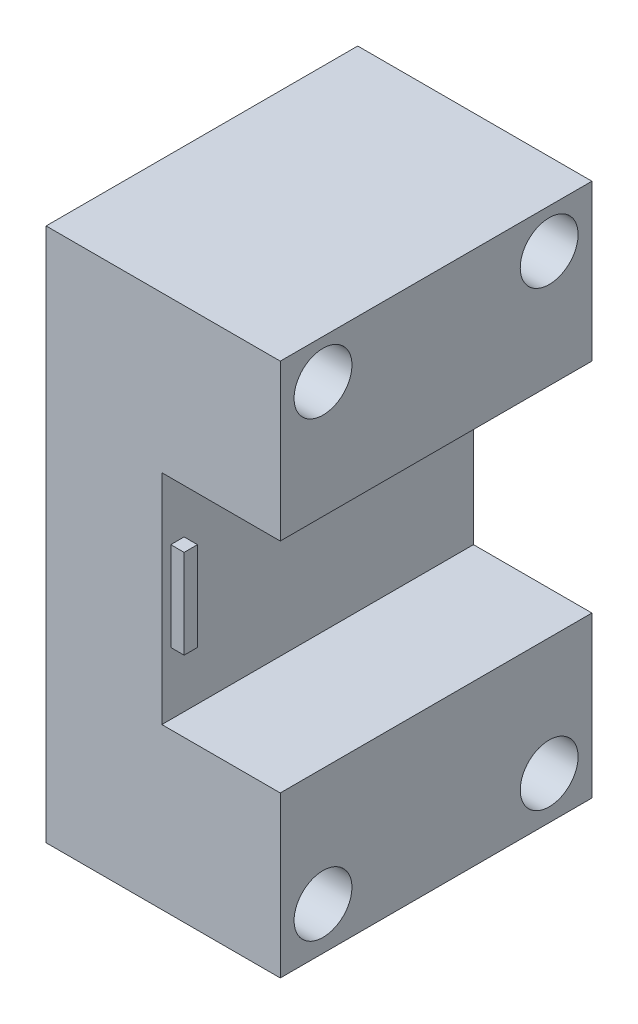
ISO-10303-21;
HEADER;
FILE_DESCRIPTION(('STEP AP214'),'2;1');
FILE_NAME('part.step','',(''),(''),'','','');
FILE_SCHEMA(('AUTOMOTIVE_DESIGN { 1 0 10303 214 1 1 1 1 }'));
ENDSEC;
DATA;
#1=APPLICATION_CONTEXT('core data for automotive mechanical design processes');
#2=APPLICATION_PROTOCOL_DEFINITION('international standard','automotive_design',2000,#1);
#3=PRODUCT_CONTEXT('',#1,'mechanical');
#4=PRODUCT('Part','Part','',(#3));
#5=PRODUCT_RELATED_PRODUCT_CATEGORY('part','',(#4));
#6=PRODUCT_DEFINITION_FORMATION('','',#4);
#7=PRODUCT_DEFINITION_CONTEXT('part definition',#1,'design');
#8=PRODUCT_DEFINITION('design','',#6,#7);
#9=PRODUCT_DEFINITION_SHAPE('','',#8);
#10=(LENGTH_UNIT() NAMED_UNIT(*) SI_UNIT(.MILLI.,.METRE.));
#11=(NAMED_UNIT(*) PLANE_ANGLE_UNIT() SI_UNIT($,.RADIAN.));
#12=(NAMED_UNIT(*) SI_UNIT($,.STERADIAN.) SOLID_ANGLE_UNIT());
#13=UNCERTAINTY_MEASURE_WITH_UNIT(LENGTH_MEASURE(1.E-05),#10,'distance_accuracy_value','');
#14=(GEOMETRIC_REPRESENTATION_CONTEXT(3) GLOBAL_UNCERTAINTY_ASSIGNED_CONTEXT((#13)) GLOBAL_UNIT_ASSIGNED_CONTEXT((#10,
#11,#12)) REPRESENTATION_CONTEXT('',''));
#15=CARTESIAN_POINT('',(0.,0.,0.));
#16=DIRECTION('',(0.,0.,1.));
#17=DIRECTION('',(1.,0.,0.));
#18=AXIS2_PLACEMENT_3D('',#15,#16,#17);
#19=CARTESIAN_POINT('',(13.,60.,-35.));
#20=DIRECTION('',(-1.,0.,0.));
#21=DIRECTION('',(0.,-1.,0.));
#22=AXIS2_PLACEMENT_3D('',#19,#20,#21);
#23=PLANE('',#22);
#24=DIRECTION('',(0.,-1.,0.));
#25=VECTOR('',#24,1.);
#26=CARTESIAN_POINT('',(13.,60.,0.));
#27=LINE('',#26,#25);
#28=CARTESIAN_POINT('',(13.,42.5,0.));
#29=VERTEX_POINT('',#28);
#30=CARTESIAN_POINT('',(13.,18.,0.));
#31=VERTEX_POINT('',#30);
#32=EDGE_CURVE('E63',#29,#31,#27,.T.);
#33=ORIENTED_EDGE('',*,*,#32,.T.);
#34=DIRECTION('',(0.,0.,1.));
#35=VECTOR('',#34,1.);
#36=CARTESIAN_POINT('',(13.,18.,-57.3805719319235));
#37=LINE('',#36,#35);
#38=CARTESIAN_POINT('',(13.,18.,-35.));
#39=VERTEX_POINT('',#38);
#40=EDGE_CURVE('E58',#39,#31,#37,.T.);
#41=ORIENTED_EDGE('',*,*,#40,.F.);
#42=DIRECTION('',(0.,-1.,0.));
#43=VECTOR('',#42,1.);
#44=CARTESIAN_POINT('',(13.,60.,-35.));
#45=LINE('',#44,#43);
#46=CARTESIAN_POINT('',(13.,42.5,-35.));
#47=VERTEX_POINT('',#46);
#48=EDGE_CURVE('E137',#47,#39,#45,.T.);
#49=ORIENTED_EDGE('',*,*,#48,.F.);
#50=DIRECTION('',(0.,0.,1.));
#51=VECTOR('',#50,1.);
#52=CARTESIAN_POINT('',(13.,42.5,-57.3805719319235));
#53=LINE('',#52,#51);
#54=EDGE_CURVE('E172',#47,#29,#53,.T.);
#55=ORIENTED_EDGE('',*,*,#54,.T.);
#56=EDGE_LOOP('',(#33,#41,#49,#55));
#57=FACE_BOUND('',#56,.T.);
#58=DIRECTION('',(0.,-1.,0.));
#59=VECTOR('',#58,1.);
#60=CARTESIAN_POINT('',(13.,25.,-1.));
#61=LINE('',#60,#59);
#62=CARTESIAN_POINT('',(13.,35.,-1.));
#63=VERTEX_POINT('',#62);
#64=CARTESIAN_POINT('',(13.,25.,-1.));
#65=VERTEX_POINT('',#64);
#66=EDGE_CURVE('E179',#63,#65,#61,.T.);
#67=ORIENTED_EDGE('',*,*,#66,.F.);
#68=DIRECTION('',(0.,0.,1.));
#69=VECTOR('',#68,1.);
#70=CARTESIAN_POINT('',(13.,35.,-1.));
#71=LINE('',#70,#69);
#72=CARTESIAN_POINT('',(13.,35.,-2.5));
#73=VERTEX_POINT('',#72);
#74=EDGE_CURVE('E184',#73,#63,#71,.T.);
#75=ORIENTED_EDGE('',*,*,#74,.F.);
#76=DIRECTION('',(0.,1.,0.));
#77=VECTOR('',#76,1.);
#78=CARTESIAN_POINT('',(13.,25.,-2.5));
#79=LINE('',#78,#77);
#80=CARTESIAN_POINT('',(13.,25.,-2.5));
#81=VERTEX_POINT('',#80);
#82=EDGE_CURVE('E196',#81,#73,#79,.T.);
#83=ORIENTED_EDGE('',*,*,#82,.F.);
#84=DIRECTION('',(0.,0.,-1.));
#85=VECTOR('',#84,1.);
#86=CARTESIAN_POINT('',(13.,25.,-1.));
#87=LINE('',#86,#85);
#88=EDGE_CURVE('E193',#65,#81,#87,.T.);
#89=ORIENTED_EDGE('',*,*,#88,.F.);
#90=EDGE_LOOP('',(#67,#75,#83,#89));
#91=FACE_BOUND('',#90,.T.);
#92=ADVANCED_FACE('F43',(#57,#91),#23,.F.);
#93=CARTESIAN_POINT('',(0.,60.,-35.));
#94=DIRECTION('',(-1.,0.,0.));
#95=DIRECTION('',(0.,-1.,0.));
#96=AXIS2_PLACEMENT_3D('',#93,#94,#95);
#97=PLANE('',#96);
#98=CARTESIAN_POINT('',(0.,55.6,-4.8));
#99=DIRECTION('',(1.,0.,0.));
#100=DIRECTION('',(0.,1.,0.));
#101=AXIS2_PLACEMENT_3D('',#98,#99,#100);
#102=CIRCLE('',#101,3.25);
#103=CARTESIAN_POINT('',(0.,58.85,-4.8));
#104=VERTEX_POINT('',#103);
#105=EDGE_CURVE('E334',#104,#104,#102,.T.);
#106=ORIENTED_EDGE('',*,*,#105,.T.);
#107=EDGE_LOOP('',(#106));
#108=FACE_BOUND('',#107,.T.);
#109=CARTESIAN_POINT('',(0.,55.6,-30.2));
#110=DIRECTION('',(1.,0.,0.));
#111=DIRECTION('',(0.,1.,0.));
#112=AXIS2_PLACEMENT_3D('',#109,#110,#111);
#113=CIRCLE('',#112,3.24999999999998);
#114=CARTESIAN_POINT('',(0.,58.85,-30.2));
#115=VERTEX_POINT('',#114);
#116=EDGE_CURVE('E328',#115,#115,#113,.T.);
#117=ORIENTED_EDGE('',*,*,#116,.T.);
#118=EDGE_LOOP('',(#117));
#119=FACE_BOUND('',#118,.T.);
#120=CARTESIAN_POINT('',(0.,4.8,-30.2));
#121=DIRECTION('',(1.,0.,0.));
#122=DIRECTION('',(0.,1.,0.));
#123=AXIS2_PLACEMENT_3D('',#120,#121,#122);
#124=CIRCLE('',#123,3.24999999999999);
#125=CARTESIAN_POINT('',(0.,8.04999999999999,-30.2));
#126=VERTEX_POINT('',#125);
#127=EDGE_CURVE('E316',#126,#126,#124,.T.);
#128=ORIENTED_EDGE('',*,*,#127,.T.);
#129=EDGE_LOOP('',(#128));
#130=FACE_BOUND('',#129,.T.);
#131=CARTESIAN_POINT('',(0.,4.79999999999999,-4.8));
#132=DIRECTION('',(1.,0.,0.));
#133=DIRECTION('',(0.,1.,0.));
#134=AXIS2_PLACEMENT_3D('',#131,#132,#133);
#135=CIRCLE('',#134,3.25);
#136=CARTESIAN_POINT('',(0.,8.05,-4.8));
#137=VERTEX_POINT('',#136);
#138=EDGE_CURVE('E140',#137,#137,#135,.T.);
#139=ORIENTED_EDGE('',*,*,#138,.T.);
#140=EDGE_LOOP('',(#139));
#141=FACE_BOUND('',#140,.T.);
#142=DIRECTION('',(0.,-1.,0.));
#143=VECTOR('',#142,1.);
#144=CARTESIAN_POINT('',(0.,60.,0.));
#145=LINE('',#144,#143);
#146=CARTESIAN_POINT('',(0.,60.,0.));
#147=VERTEX_POINT('',#146);
#148=CARTESIAN_POINT('',(0.,0.,0.));
#149=VERTEX_POINT('',#148);
#150=EDGE_CURVE('E212',#147,#149,#145,.T.);
#151=ORIENTED_EDGE('',*,*,#150,.F.);
#152=DIRECTION('',(0.,0.,1.));
#153=VECTOR('',#152,1.);
#154=CARTESIAN_POINT('',(0.,60.,-35.));
#155=LINE('',#154,#153);
#156=CARTESIAN_POINT('',(0.,60.,-35.));
#157=VERTEX_POINT('',#156);
#158=EDGE_CURVE('E12',#157,#147,#155,.T.);
#159=ORIENTED_EDGE('',*,*,#158,.F.);
#160=DIRECTION('',(0.,-1.,0.));
#161=VECTOR('',#160,1.);
#162=CARTESIAN_POINT('',(0.,60.,-35.));
#163=LINE('',#162,#161);
#164=CARTESIAN_POINT('',(0.,0.,-35.));
#165=VERTEX_POINT('',#164);
#166=EDGE_CURVE('E213',#157,#165,#163,.T.);
#167=ORIENTED_EDGE('',*,*,#166,.T.);
#168=DIRECTION('',(0.,0.,1.));
#169=VECTOR('',#168,1.);
#170=CARTESIAN_POINT('',(0.,0.,-35.));
#171=LINE('',#170,#169);
#172=EDGE_CURVE('E47',#165,#149,#171,.T.);
#173=ORIENTED_EDGE('',*,*,#172,.T.);
#174=EDGE_LOOP('',(#151,#159,#167,#173));
#175=FACE_BOUND('',#174,.T.);
#176=ADVANCED_FACE('F45',(#108,#119,#130,#141,#175),#97,.T.);
#177=CARTESIAN_POINT('',(0.,60.,-35.));
#178=DIRECTION('',(0.,-1.,0.));
#179=DIRECTION('',(0.,0.,-1.));
#180=AXIS2_PLACEMENT_3D('',#177,#178,#179);
#181=PLANE('',#180);
#182=DIRECTION('',(1.,0.,0.));
#183=VECTOR('',#182,1.);
#184=CARTESIAN_POINT('',(0.,60.,0.));
#185=LINE('',#184,#183);
#186=CARTESIAN_POINT('',(26.3,60.,0.));
#187=VERTEX_POINT('',#186);
#188=EDGE_CURVE('E217',#147,#187,#185,.T.);
#189=ORIENTED_EDGE('',*,*,#188,.T.);
#190=DIRECTION('',(0.,0.,1.));
#191=VECTOR('',#190,1.);
#192=CARTESIAN_POINT('',(26.3,60.,-57.3805719319235));
#193=LINE('',#192,#191);
#194=CARTESIAN_POINT('',(26.3,60.,-35.));
#195=VERTEX_POINT('',#194);
#196=EDGE_CURVE('E166',#195,#187,#193,.T.);
#197=ORIENTED_EDGE('',*,*,#196,.F.);
#198=DIRECTION('',(1.,0.,0.));
#199=VECTOR('',#198,1.);
#200=CARTESIAN_POINT('',(0.,60.,-35.));
#201=LINE('',#200,#199);
#202=EDGE_CURVE('E220',#157,#195,#201,.T.);
#203=ORIENTED_EDGE('',*,*,#202,.F.);
#204=ORIENTED_EDGE('',*,*,#158,.T.);
#205=EDGE_LOOP('',(#189,#197,#203,#204));
#206=FACE_BOUND('',#205,.T.);
#207=ADVANCED_FACE('F230',(#206),#181,.F.);
#208=CARTESIAN_POINT('',(0.,0.,-35.));
#209=DIRECTION('',(0.,-1.,0.));
#210=DIRECTION('',(0.,0.,-1.));
#211=AXIS2_PLACEMENT_3D('',#208,#209,#210);
#212=PLANE('',#211);
#213=DIRECTION('',(1.,0.,0.));
#214=VECTOR('',#213,1.);
#215=CARTESIAN_POINT('',(0.,0.,0.));
#216=LINE('',#215,#214);
#217=CARTESIAN_POINT('',(26.3,0.,0.));
#218=VERTEX_POINT('',#217);
#219=EDGE_CURVE('E224',#149,#218,#216,.T.);
#220=ORIENTED_EDGE('',*,*,#219,.F.);
#221=ORIENTED_EDGE('',*,*,#172,.F.);
#222=DIRECTION('',(1.,0.,0.));
#223=VECTOR('',#222,1.);
#224=CARTESIAN_POINT('',(0.,0.,-35.));
#225=LINE('',#224,#223);
#226=CARTESIAN_POINT('',(26.3,0.,-35.));
#227=VERTEX_POINT('',#226);
#228=EDGE_CURVE('E216',#165,#227,#225,.T.);
#229=ORIENTED_EDGE('',*,*,#228,.T.);
#230=DIRECTION('',(0.,0.,1.));
#231=VECTOR('',#230,1.);
#232=CARTESIAN_POINT('',(26.3,0.,-57.3805719319235));
#233=LINE('',#232,#231);
#234=EDGE_CURVE('E148',#227,#218,#233,.T.);
#235=ORIENTED_EDGE('',*,*,#234,.T.);
#236=EDGE_LOOP('',(#220,#221,#229,#235));
#237=FACE_BOUND('',#236,.T.);
#238=ADVANCED_FACE('F248',(#237),#212,.T.);
#239=CARTESIAN_POINT('',(0.,0.,-35.));
#240=DIRECTION('',(0.,0.,1.));
#241=DIRECTION('',(1.,0.,0.));
#242=AXIS2_PLACEMENT_3D('',#239,#240,#241);
#243=PLANE('',#242);
#244=ORIENTED_EDGE('',*,*,#166,.F.);
#245=ORIENTED_EDGE('',*,*,#202,.T.);
#246=DIRECTION('',(0.,-1.,0.));
#247=VECTOR('',#246,1.);
#248=CARTESIAN_POINT('',(26.3,60.,-35.));
#249=LINE('',#248,#247);
#250=CARTESIAN_POINT('',(26.3,42.5,-35.));
#251=VERTEX_POINT('',#250);
#252=EDGE_CURVE('E163',#195,#251,#249,.T.);
#253=ORIENTED_EDGE('',*,*,#252,.T.);
#254=DIRECTION('',(-1.,0.,0.));
#255=VECTOR('',#254,1.);
#256=CARTESIAN_POINT('',(26.3,42.5,-35.));
#257=LINE('',#256,#255);
#258=EDGE_CURVE('E165',#251,#47,#257,.T.);
#259=ORIENTED_EDGE('',*,*,#258,.T.);
#260=ORIENTED_EDGE('',*,*,#48,.T.);
#261=DIRECTION('',(1.,0.,0.));
#262=VECTOR('',#261,1.);
#263=CARTESIAN_POINT('',(13.,18.,-35.));
#264=LINE('',#263,#262);
#265=CARTESIAN_POINT('',(26.3,18.,-35.));
#266=VERTEX_POINT('',#265);
#267=EDGE_CURVE('E129',#39,#266,#264,.T.);
#268=ORIENTED_EDGE('',*,*,#267,.T.);
#269=DIRECTION('',(0.,-1.,0.));
#270=VECTOR('',#269,1.);
#271=CARTESIAN_POINT('',(26.3,18.,-35.));
#272=LINE('',#271,#270);
#273=EDGE_CURVE('E134',#266,#227,#272,.T.);
#274=ORIENTED_EDGE('',*,*,#273,.T.);
#275=ORIENTED_EDGE('',*,*,#228,.F.);
#276=EDGE_LOOP('',(#244,#245,#253,#259,#260,#268,#274,#275));
#277=FACE_BOUND('',#276,.T.);
#278=ADVANCED_FACE('F132',(#277),#243,.F.);
#279=CARTESIAN_POINT('',(0.,0.,0.));
#280=DIRECTION('',(0.,0.,1.));
#281=DIRECTION('',(1.,0.,0.));
#282=AXIS2_PLACEMENT_3D('',#279,#280,#281);
#283=PLANE('',#282);
#284=ORIENTED_EDGE('',*,*,#150,.T.);
#285=ORIENTED_EDGE('',*,*,#219,.T.);
#286=DIRECTION('',(0.,1.,0.));
#287=VECTOR('',#286,1.);
#288=CARTESIAN_POINT('',(26.3,18.,0.));
#289=LINE('',#288,#287);
#290=CARTESIAN_POINT('',(26.3,18.,0.));
#291=VERTEX_POINT('',#290);
#292=EDGE_CURVE('E160',#218,#291,#289,.T.);
#293=ORIENTED_EDGE('',*,*,#292,.T.);
#294=DIRECTION('',(-1.,0.,0.));
#295=VECTOR('',#294,1.);
#296=CARTESIAN_POINT('',(13.,18.,0.));
#297=LINE('',#296,#295);
#298=EDGE_CURVE('E153',#291,#31,#297,.T.);
#299=ORIENTED_EDGE('',*,*,#298,.T.);
#300=ORIENTED_EDGE('',*,*,#32,.F.);
#301=DIRECTION('',(1.,0.,0.));
#302=VECTOR('',#301,1.);
#303=CARTESIAN_POINT('',(26.3,42.5,0.));
#304=LINE('',#303,#302);
#305=CARTESIAN_POINT('',(26.3,42.5,0.));
#306=VERTEX_POINT('',#305);
#307=EDGE_CURVE('E161',#29,#306,#304,.T.);
#308=ORIENTED_EDGE('',*,*,#307,.T.);
#309=DIRECTION('',(0.,1.,0.));
#310=VECTOR('',#309,1.);
#311=CARTESIAN_POINT('',(26.3,60.,0.));
#312=LINE('',#311,#310);
#313=EDGE_CURVE('E169',#306,#187,#312,.T.);
#314=ORIENTED_EDGE('',*,*,#313,.T.);
#315=ORIENTED_EDGE('',*,*,#188,.F.);
#316=EDGE_LOOP('',(#284,#285,#293,#299,#300,#308,#314,#315));
#317=FACE_BOUND('',#316,.T.);
#318=ADVANCED_FACE('F239',(#317),#283,.T.);
#319=CARTESIAN_POINT('',(14.5,25.,-1.));
#320=DIRECTION('',(0.,0.,-1.));
#321=DIRECTION('',(-1.,0.,0.));
#322=AXIS2_PLACEMENT_3D('',#319,#320,#321);
#323=PLANE('',#322);
#324=ORIENTED_EDGE('',*,*,#66,.T.);
#325=DIRECTION('',(-1.,0.,0.));
#326=VECTOR('',#325,1.);
#327=CARTESIAN_POINT('',(14.5,25.,-1.));
#328=LINE('',#327,#326);
#329=CARTESIAN_POINT('',(14.5,25.,-1.));
#330=VERTEX_POINT('',#329);
#331=EDGE_CURVE('E209',#330,#65,#328,.T.);
#332=ORIENTED_EDGE('',*,*,#331,.F.);
#333=DIRECTION('',(0.,-1.,0.));
#334=VECTOR('',#333,1.);
#335=CARTESIAN_POINT('',(14.5,25.,-1.));
#336=LINE('',#335,#334);
#337=CARTESIAN_POINT('',(14.5,35.,-1.));
#338=VERTEX_POINT('',#337);
#339=EDGE_CURVE('E180',#338,#330,#336,.T.);
#340=ORIENTED_EDGE('',*,*,#339,.F.);
#341=DIRECTION('',(-1.,0.,0.));
#342=VECTOR('',#341,1.);
#343=CARTESIAN_POINT('',(14.5,35.,-1.));
#344=LINE('',#343,#342);
#345=EDGE_CURVE('E190',#338,#63,#344,.T.);
#346=ORIENTED_EDGE('',*,*,#345,.T.);
#347=EDGE_LOOP('',(#324,#332,#340,#346));
#348=FACE_BOUND('',#347,.T.);
#349=ADVANCED_FACE('F265',(#348),#323,.F.);
#350=CARTESIAN_POINT('',(14.5,25.,-1.));
#351=DIRECTION('',(0.,1.,0.));
#352=DIRECTION('',(-1.,0.,0.));
#353=AXIS2_PLACEMENT_3D('',#350,#351,#352);
#354=PLANE('',#353);
#355=ORIENTED_EDGE('',*,*,#88,.T.);
#356=DIRECTION('',(-1.,0.,0.));
#357=VECTOR('',#356,1.);
#358=CARTESIAN_POINT('',(14.5,25.,-2.5));
#359=LINE('',#358,#357);
#360=CARTESIAN_POINT('',(14.5,25.,-2.5));
#361=VERTEX_POINT('',#360);
#362=EDGE_CURVE('E206',#361,#81,#359,.T.);
#363=ORIENTED_EDGE('',*,*,#362,.F.);
#364=DIRECTION('',(0.,0.,-1.));
#365=VECTOR('',#364,1.);
#366=CARTESIAN_POINT('',(14.5,25.,-1.));
#367=LINE('',#366,#365);
#368=EDGE_CURVE('E183',#330,#361,#367,.T.);
#369=ORIENTED_EDGE('',*,*,#368,.F.);
#370=ORIENTED_EDGE('',*,*,#331,.T.);
#371=EDGE_LOOP('',(#355,#363,#369,#370));
#372=FACE_BOUND('',#371,.T.);
#373=ADVANCED_FACE('F269',(#372),#354,.F.);
#374=CARTESIAN_POINT('',(14.5,25.,-2.5));
#375=DIRECTION('',(0.,0.,1.));
#376=DIRECTION('',(0.,-1.,0.));
#377=AXIS2_PLACEMENT_3D('',#374,#375,#376);
#378=PLANE('',#377);
#379=ORIENTED_EDGE('',*,*,#82,.T.);
#380=DIRECTION('',(-1.,0.,0.));
#381=VECTOR('',#380,1.);
#382=CARTESIAN_POINT('',(14.5,35.,-2.5));
#383=LINE('',#382,#381);
#384=CARTESIAN_POINT('',(14.5,35.,-2.5));
#385=VERTEX_POINT('',#384);
#386=EDGE_CURVE('E203',#385,#73,#383,.T.);
#387=ORIENTED_EDGE('',*,*,#386,.F.);
#388=DIRECTION('',(0.,1.,0.));
#389=VECTOR('',#388,1.);
#390=CARTESIAN_POINT('',(14.5,25.,-2.5));
#391=LINE('',#390,#389);
#392=EDGE_CURVE('E186',#361,#385,#391,.T.);
#393=ORIENTED_EDGE('',*,*,#392,.F.);
#394=ORIENTED_EDGE('',*,*,#362,.T.);
#395=EDGE_LOOP('',(#379,#387,#393,#394));
#396=FACE_BOUND('',#395,.T.);
#397=ADVANCED_FACE('F273',(#396),#378,.F.);
#398=CARTESIAN_POINT('',(14.5,35.,-1.));
#399=DIRECTION('',(0.,-1.,0.));
#400=DIRECTION('',(1.,0.,0.));
#401=AXIS2_PLACEMENT_3D('',#398,#399,#400);
#402=PLANE('',#401);
#403=ORIENTED_EDGE('',*,*,#74,.T.);
#404=ORIENTED_EDGE('',*,*,#345,.F.);
#405=DIRECTION('',(0.,0.,1.));
#406=VECTOR('',#405,1.);
#407=CARTESIAN_POINT('',(14.5,35.,-1.));
#408=LINE('',#407,#406);
#409=EDGE_CURVE('E188',#385,#338,#408,.T.);
#410=ORIENTED_EDGE('',*,*,#409,.F.);
#411=ORIENTED_EDGE('',*,*,#386,.T.);
#412=EDGE_LOOP('',(#403,#404,#410,#411));
#413=FACE_BOUND('',#412,.T.);
#414=ADVANCED_FACE('F277',(#413),#402,.F.);
#415=CARTESIAN_POINT('',(14.5,0.,0.));
#416=DIRECTION('',(-1.,0.,0.));
#417=DIRECTION('',(0.,-1.,0.));
#418=AXIS2_PLACEMENT_3D('',#415,#416,#417);
#419=PLANE('',#418);
#420=ORIENTED_EDGE('',*,*,#339,.T.);
#421=ORIENTED_EDGE('',*,*,#368,.T.);
#422=ORIENTED_EDGE('',*,*,#392,.T.);
#423=ORIENTED_EDGE('',*,*,#409,.T.);
#424=EDGE_LOOP('',(#420,#421,#422,#423));
#425=FACE_BOUND('',#424,.T.);
#426=ADVANCED_FACE('F281',(#425),#419,.F.);
#427=CARTESIAN_POINT('',(26.3,60.,-57.3805719319235));
#428=DIRECTION('',(1.,0.,0.));
#429=DIRECTION('',(0.,1.,0.));
#430=AXIS2_PLACEMENT_3D('',#427,#428,#429);
#431=PLANE('',#430);
#432=CARTESIAN_POINT('',(26.3,55.6,-4.8));
#433=DIRECTION('',(1.,0.,0.));
#434=DIRECTION('',(0.,1.,0.));
#435=AXIS2_PLACEMENT_3D('',#432,#433,#434);
#436=CIRCLE('',#435,3.25);
#437=CARTESIAN_POINT('',(26.3,58.85,-4.8));
#438=VERTEX_POINT('',#437);
#439=EDGE_CURVE('E331',#438,#438,#436,.T.);
#440=ORIENTED_EDGE('',*,*,#439,.F.);
#441=EDGE_LOOP('',(#440));
#442=FACE_BOUND('',#441,.T.);
#443=CARTESIAN_POINT('',(26.3,55.6,-30.2));
#444=DIRECTION('',(1.,0.,0.));
#445=DIRECTION('',(0.,1.,0.));
#446=AXIS2_PLACEMENT_3D('',#443,#444,#445);
#447=CIRCLE('',#446,3.24999999999998);
#448=CARTESIAN_POINT('',(26.3,58.85,-30.2));
#449=VERTEX_POINT('',#448);
#450=EDGE_CURVE('E323',#449,#449,#447,.T.);
#451=ORIENTED_EDGE('',*,*,#450,.F.);
#452=EDGE_LOOP('',(#451));
#453=FACE_BOUND('',#452,.T.);
#454=ORIENTED_EDGE('',*,*,#252,.F.);
#455=ORIENTED_EDGE('',*,*,#196,.T.);
#456=ORIENTED_EDGE('',*,*,#313,.F.);
#457=DIRECTION('',(0.,0.,1.));
#458=VECTOR('',#457,1.);
#459=CARTESIAN_POINT('',(26.3,42.5,-57.3805719319235));
#460=LINE('',#459,#458);
#461=EDGE_CURVE('E175',#251,#306,#460,.T.);
#462=ORIENTED_EDGE('',*,*,#461,.F.);
#463=EDGE_LOOP('',(#454,#455,#456,#462));
#464=FACE_BOUND('',#463,.T.);
#465=ADVANCED_FACE('F237',(#442,#453,#464),#431,.T.);
#466=CARTESIAN_POINT('',(26.3,42.5,-57.3805719319235));
#467=DIRECTION('',(0.,-1.,0.));
#468=DIRECTION('',(0.,0.,-1.));
#469=AXIS2_PLACEMENT_3D('',#466,#467,#468);
#470=PLANE('',#469);
#471=ORIENTED_EDGE('',*,*,#258,.F.);
#472=ORIENTED_EDGE('',*,*,#461,.T.);
#473=ORIENTED_EDGE('',*,*,#307,.F.);
#474=ORIENTED_EDGE('',*,*,#54,.F.);
#475=EDGE_LOOP('',(#471,#472,#473,#474));
#476=FACE_BOUND('',#475,.T.);
#477=ADVANCED_FACE('F244',(#476),#470,.T.);
#478=CARTESIAN_POINT('',(13.,18.,-57.3805719319235));
#479=DIRECTION('',(0.,1.,0.));
#480=DIRECTION('',(0.,0.,1.));
#481=AXIS2_PLACEMENT_3D('',#478,#479,#480);
#482=PLANE('',#481);
#483=ORIENTED_EDGE('',*,*,#267,.F.);
#484=ORIENTED_EDGE('',*,*,#40,.T.);
#485=ORIENTED_EDGE('',*,*,#298,.F.);
#486=DIRECTION('',(0.,0.,1.));
#487=VECTOR('',#486,1.);
#488=CARTESIAN_POINT('',(26.3,18.,-57.3805719319235));
#489=LINE('',#488,#487);
#490=EDGE_CURVE('E145',#266,#291,#489,.T.);
#491=ORIENTED_EDGE('',*,*,#490,.F.);
#492=EDGE_LOOP('',(#483,#484,#485,#491));
#493=FACE_BOUND('',#492,.T.);
#494=ADVANCED_FACE('F151',(#493),#482,.T.);
#495=CARTESIAN_POINT('',(26.3,18.,-57.3805719319235));
#496=DIRECTION('',(1.,0.,0.));
#497=DIRECTION('',(0.,1.,0.));
#498=AXIS2_PLACEMENT_3D('',#495,#496,#497);
#499=PLANE('',#498);
#500=CARTESIAN_POINT('',(26.3,4.8,-30.2));
#501=DIRECTION('',(1.,0.,0.));
#502=DIRECTION('',(0.,1.,0.));
#503=AXIS2_PLACEMENT_3D('',#500,#501,#502);
#504=CIRCLE('',#503,3.24999999999999);
#505=CARTESIAN_POINT('',(26.3,8.05,-30.2));
#506=VERTEX_POINT('',#505);
#507=EDGE_CURVE('E319',#506,#506,#504,.T.);
#508=ORIENTED_EDGE('',*,*,#507,.F.);
#509=EDGE_LOOP('',(#508));
#510=FACE_BOUND('',#509,.T.);
#511=CARTESIAN_POINT('',(26.3,4.8,-4.8));
#512=DIRECTION('',(1.,0.,0.));
#513=DIRECTION('',(0.,1.,0.));
#514=AXIS2_PLACEMENT_3D('',#511,#512,#513);
#515=CIRCLE('',#514,3.25);
#516=CARTESIAN_POINT('',(26.3,8.05,-4.8));
#517=VERTEX_POINT('',#516);
#518=EDGE_CURVE('E320',#517,#517,#515,.T.);
#519=ORIENTED_EDGE('',*,*,#518,.F.);
#520=EDGE_LOOP('',(#519));
#521=FACE_BOUND('',#520,.T.);
#522=ORIENTED_EDGE('',*,*,#273,.F.);
#523=ORIENTED_EDGE('',*,*,#490,.T.);
#524=ORIENTED_EDGE('',*,*,#292,.F.);
#525=ORIENTED_EDGE('',*,*,#234,.F.);
#526=EDGE_LOOP('',(#522,#523,#524,#525));
#527=FACE_BOUND('',#526,.T.);
#528=ADVANCED_FACE('F143',(#510,#521,#527),#499,.T.);
#529=CARTESIAN_POINT('',(0.,4.79999999999999,-4.8));
#530=DIRECTION('',(1.,0.,0.));
#531=DIRECTION('',(0.,1.,0.));
#532=AXIS2_PLACEMENT_3D('',#529,#530,#531);
#533=CYLINDRICAL_SURFACE('',#532,3.25);
#534=ORIENTED_EDGE('',*,*,#138,.F.);
#535=EDGE_LOOP('',(#534));
#536=FACE_BOUND('',#535,.T.);
#537=ORIENTED_EDGE('',*,*,#518,.T.);
#538=EDGE_LOOP('',(#537));
#539=FACE_BOUND('',#538,.T.);
#540=ADVANCED_FACE('F295',(#536,#539),#533,.F.);
#541=CARTESIAN_POINT('',(0.,4.8,-30.2));
#542=DIRECTION('',(1.,0.,0.));
#543=DIRECTION('',(0.,1.,0.));
#544=AXIS2_PLACEMENT_3D('',#541,#542,#543);
#545=CYLINDRICAL_SURFACE('',#544,3.24999999999999);
#546=ORIENTED_EDGE('',*,*,#127,.F.);
#547=EDGE_LOOP('',(#546));
#548=FACE_BOUND('',#547,.T.);
#549=ORIENTED_EDGE('',*,*,#507,.T.);
#550=EDGE_LOOP('',(#549));
#551=FACE_BOUND('',#550,.T.);
#552=ADVANCED_FACE('F299',(#548,#551),#545,.F.);
#553=CARTESIAN_POINT('',(0.,55.6,-30.2));
#554=DIRECTION('',(1.,0.,0.));
#555=DIRECTION('',(0.,1.,0.));
#556=AXIS2_PLACEMENT_3D('',#553,#554,#555);
#557=CYLINDRICAL_SURFACE('',#556,3.24999999999998);
#558=ORIENTED_EDGE('',*,*,#116,.F.);
#559=EDGE_LOOP('',(#558));
#560=FACE_BOUND('',#559,.T.);
#561=ORIENTED_EDGE('',*,*,#450,.T.);
#562=EDGE_LOOP('',(#561));
#563=FACE_BOUND('',#562,.T.);
#564=ADVANCED_FACE('F304',(#560,#563),#557,.F.);
#565=CARTESIAN_POINT('',(0.,55.6,-4.8));
#566=DIRECTION('',(1.,0.,0.));
#567=DIRECTION('',(0.,1.,0.));
#568=AXIS2_PLACEMENT_3D('',#565,#566,#567);
#569=CYLINDRICAL_SURFACE('',#568,3.25);
#570=ORIENTED_EDGE('',*,*,#105,.F.);
#571=EDGE_LOOP('',(#570));
#572=FACE_BOUND('',#571,.T.);
#573=ORIENTED_EDGE('',*,*,#439,.T.);
#574=EDGE_LOOP('',(#573));
#575=FACE_BOUND('',#574,.T.);
#576=ADVANCED_FACE('F301',(#572,#575),#569,.F.);
#577=CLOSED_SHELL('',(#92,#176,#207,#238,#278,#318,#349,#373,#397,#414,#426,#465,#477,#494,#528,
#540,#552,#564,#576));
#578=MANIFOLD_SOLID_BREP('B2',#577);
#579=ADVANCED_BREP_SHAPE_REPRESENTATION('',(#18,#578),#14);
#580=SHAPE_DEFINITION_REPRESENTATION(#9,#579);
ENDSEC;
END-ISO-10303-21;
